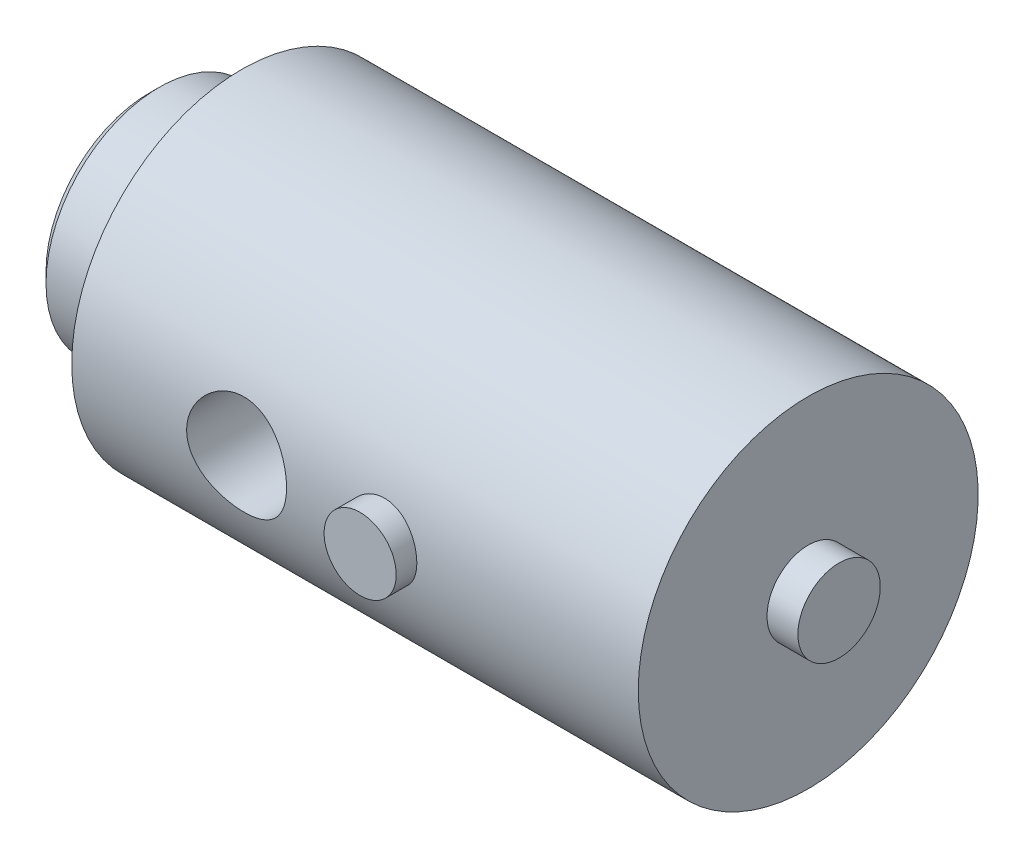
ISO-10303-21;
HEADER;
FILE_DESCRIPTION(('STEP AP214'),'2;1');
FILE_NAME('part.step','',(''),(''),'','','');
FILE_SCHEMA(('AUTOMOTIVE_DESIGN { 1 0 10303 214 1 1 1 1 }'));
ENDSEC;
DATA;
#1=APPLICATION_CONTEXT('core data for automotive mechanical design processes');
#2=APPLICATION_PROTOCOL_DEFINITION('international standard','automotive_design',2000,#1);
#3=PRODUCT_CONTEXT('',#1,'mechanical');
#4=PRODUCT('Part','Part','',(#3));
#5=PRODUCT_RELATED_PRODUCT_CATEGORY('part','',(#4));
#6=PRODUCT_DEFINITION_FORMATION('','',#4);
#7=PRODUCT_DEFINITION_CONTEXT('part definition',#1,'design');
#8=PRODUCT_DEFINITION('design','',#6,#7);
#9=PRODUCT_DEFINITION_SHAPE('','',#8);
#10=(LENGTH_UNIT() NAMED_UNIT(*) SI_UNIT(.MILLI.,.METRE.));
#11=(NAMED_UNIT(*) PLANE_ANGLE_UNIT() SI_UNIT($,.RADIAN.));
#12=(NAMED_UNIT(*) SI_UNIT($,.STERADIAN.) SOLID_ANGLE_UNIT());
#13=UNCERTAINTY_MEASURE_WITH_UNIT(LENGTH_MEASURE(1.E-05),#10,'distance_accuracy_value','');
#14=(GEOMETRIC_REPRESENTATION_CONTEXT(3) GLOBAL_UNCERTAINTY_ASSIGNED_CONTEXT((#13)) GLOBAL_UNIT_ASSIGNED_CONTEXT((#10,
#11,#12)) REPRESENTATION_CONTEXT('',''));
#15=CARTESIAN_POINT('',(0.,0.,0.));
#16=DIRECTION('',(0.,0.,1.));
#17=DIRECTION('',(1.,0.,0.));
#18=AXIS2_PLACEMENT_3D('',#15,#16,#17);
#19=CARTESIAN_POINT('',(0.,0.,0.));
#20=DIRECTION('',(-1.,0.,0.));
#21=DIRECTION('',(0.,0.,1.));
#22=AXIS2_PLACEMENT_3D('',#19,#20,#21);
#23=CYLINDRICAL_SURFACE('',#22,16.5);
#24=CARTESIAN_POINT('',(29.85,0.,16.5));
#25=CARTESIAN_POINT('',(29.8499961196827,-0.266313099430706,16.4999973112837));
#26=CARTESIAN_POINT('',(29.8279922538417,-0.532665609339345,16.4934904971186));
#27=CARTESIAN_POINT('',(29.7407568949876,-1.05762988449565,16.4681684464036));
#28=CARTESIAN_POINT('',(29.6755110262611,-1.31623904558994,16.4493491166101));
#29=CARTESIAN_POINT('',(29.5041469025472,-1.81806796248393,16.4014670005546));
#30=CARTESIAN_POINT('',(29.3980875321022,-2.061309304615,16.3724189770618));
#31=CARTESIAN_POINT('',(29.1483441872767,-2.52655565352261,16.3071081790808));
#32=CARTESIAN_POINT('',(29.0046556599439,-2.74855808604917,16.2708445316633));
#33=CARTESIAN_POINT('',(28.6795410613906,-3.17116857056475,16.1938573265638));
#34=CARTESIAN_POINT('',(28.4972638681665,-3.37110567982261,16.1530451536091));
#35=CARTESIAN_POINT('',(28.1019610925906,-3.73805952591685,16.0720967406786));
#36=CARTESIAN_POINT('',(27.8889305929116,-3.90507098795557,16.0319606099473));
#37=CARTESIAN_POINT('',(27.4325526752913,-4.20491349203635,15.9559772057137));
#38=CARTESIAN_POINT('',(27.1886530114083,-4.33693459213361,15.9202403846904));
#39=CARTESIAN_POINT('',(26.680894774768,-4.55781666639526,15.8584222701326));
#40=CARTESIAN_POINT('',(26.4170407950119,-4.64668753796426,15.8323387627361));
#41=CARTESIAN_POINT('',(25.8843793418325,-4.77634392105235,15.7937023909635));
#42=CARTESIAN_POINT('',(25.6158978167385,-4.8183626222715,15.7808033060013));
#43=CARTESIAN_POINT('',(25.0754100967276,-4.85697165542918,15.7689654189497));
#44=CARTESIAN_POINT('',(24.8034047321296,-4.85357250140307,15.770023385863));
#45=CARTESIAN_POINT('',(24.2735400379876,-4.80241288726491,15.7856726353637));
#46=CARTESIAN_POINT('',(24.0155164366108,-4.75618705372918,15.799795724023));
#47=CARTESIAN_POINT('',(23.5110611243956,-4.62316161456268,15.8392279421637));
#48=CARTESIAN_POINT('',(23.2646305187144,-4.53635814926907,15.8645381357277));
#49=CARTESIAN_POINT('',(22.7865563527456,-4.32348875523525,15.9238734817613));
#50=CARTESIAN_POINT('',(22.5551521445048,-4.19691756137558,15.9580097241808));
#51=CARTESIAN_POINT('',(22.1163486631105,-3.90845697484941,16.0310962904494));
#52=CARTESIAN_POINT('',(21.9089550232761,-3.74655931954656,16.0700477396196));
#53=CARTESIAN_POINT('',(21.5153430358983,-3.38437699013866,16.1502842632036));
#54=CARTESIAN_POINT('',(21.3303036637376,-3.1828157813768,16.1916003575345));
#55=CARTESIAN_POINT('',(20.9963845658037,-2.75100983735299,16.2705270146006));
#56=CARTESIAN_POINT('',(20.8475069381581,-2.52076343892997,16.3081373622508));
#57=CARTESIAN_POINT('',(20.5894598522105,-2.03604079283969,16.3757353654198));
#58=CARTESIAN_POINT('',(20.4805427378995,-1.78142294937746,16.4056742307054));
#59=CARTESIAN_POINT('',(20.30742025289,-1.25640097029208,16.4542044347623));
#60=CARTESIAN_POINT('',(20.2432029287793,-0.98600107601199,16.4727988070613));
#61=CARTESIAN_POINT('',(20.1632443944241,-0.447120678527272,16.4960690980954));
#62=CARTESIAN_POINT('',(20.1459044214456,-0.178896854199385,16.5012038665931));
#63=CARTESIAN_POINT('',(20.1557242210682,0.356641100695489,16.4983174479598));
#64=CARTESIAN_POINT('',(20.1828783131476,0.623955343022091,16.4902979402247));
#65=CARTESIAN_POINT('',(20.2796187472645,1.14411408539238,16.4623037687492));
#66=CARTESIAN_POINT('',(20.3482789471892,1.39714620713867,16.4425902137105));
#67=CARTESIAN_POINT('',(20.5249757063805,1.88805080173555,16.3934795973251));
#68=CARTESIAN_POINT('',(20.6330169265954,2.12592147623325,16.364081389789));
#69=CARTESIAN_POINT('',(20.8881452430914,2.58569646623036,16.2978335161278));
#70=CARTESIAN_POINT('',(21.0360565634191,2.80712081409418,16.2608310055204));
#71=CARTESIAN_POINT('',(21.3657185818254,3.22255405875549,16.1836295535749));
#72=CARTESIAN_POINT('',(21.5474774275044,3.41655633483431,16.1434298439611));
#73=CARTESIAN_POINT('',(21.9471799322096,3.77862265523459,16.0626168452914));
#74=CARTESIAN_POINT('',(22.166161822236,3.94555058412877,16.0220377577234));
#75=CARTESIAN_POINT('',(22.6299089551124,4.24035930094474,15.9465543190043));
#76=CARTESIAN_POINT('',(22.8746734176669,4.36824127011471,15.9116497961967));
#77=CARTESIAN_POINT('',(23.3821493557454,4.58042491099468,15.851872884565));
#78=CARTESIAN_POINT('',(23.6447642423884,4.66494281020275,15.8269508590528));
#79=CARTESIAN_POINT('',(24.181361611196,4.78832494386539,15.7900655833111));
#80=CARTESIAN_POINT('',(24.4553403641565,4.82720403448501,15.7780981162636));
#81=CARTESIAN_POINT('',(24.9951196373536,4.85722292205786,15.7688807678544));
#82=CARTESIAN_POINT('',(25.2608091086529,4.85020947418275,15.7710615190994));
#83=CARTESIAN_POINT('',(25.7870411307971,4.79302700928179,15.788532745172));
#84=CARTESIAN_POINT('',(26.0475838722524,4.74285959355071,15.803822733561));
#85=CARTESIAN_POINT('',(26.5532402953346,4.60196368270533,15.8454154927705));
#86=CARTESIAN_POINT('',(26.7984963517818,4.51170561574423,15.8715903188533));
#87=CARTESIAN_POINT('',(27.2705794212813,4.29355544594646,15.9319846007599));
#88=CARTESIAN_POINT('',(27.4974030082951,4.16565636710857,15.9662055475331));
#89=CARTESIAN_POINT('',(27.9347995139494,3.87059018108712,16.0403369782394));
#90=CARTESIAN_POINT('',(28.1445216005102,3.70220141234594,16.0804051049316));
#91=CARTESIAN_POINT('',(28.5333310327687,3.33315815336859,16.1609304094528));
#92=CARTESIAN_POINT('',(28.7124105144591,3.13249540601069,16.201387684346));
#93=CARTESIAN_POINT('',(29.0397788208968,2.69790892993745,16.2794746451327));
#94=CARTESIAN_POINT('',(29.1870783826878,2.46321840669052,16.3169950943397));
#95=CARTESIAN_POINT('',(29.439916677696,1.97130031618815,16.383693643058));
#96=CARTESIAN_POINT('',(29.545476371879,1.71408414036051,16.4128759277888));
#97=CARTESIAN_POINT('',(29.7015417170053,1.21571352394952,16.4568251477284));
#98=CARTESIAN_POINT('',(29.7570670036022,0.976235037450141,16.4728850294782));
#99=CARTESIAN_POINT('',(29.8312951329554,0.49118158518838,16.4944728941833));
#100=CARTESIAN_POINT('',(29.850003578627,0.245607552828417,16.5000024796717));
#101=CARTESIAN_POINT('',(29.85,0.,16.5));
#102=B_SPLINE_CURVE_WITH_KNOTS('',3,(#24,#25,#26,#27,#28,#29,#30,#31,#32,#33,#34,#35,#36,#37,
#38,#39,#40,#41,#42,#43,#44,#45,#46,#47,#48,#49,#50,#51,#52,#53,#54,#55,#56,#57,#58,#59,#60,#61,
#62,#63,#64,#65,#66,#67,#68,#69,#70,#71,#72,#73,#74,#75,#76,#77,#78,#79,#80,#81,#82,#83,#84,#85,
#86,#87,#88,#89,#90,#91,#92,#93,#94,#95,#96,#97,#98,#99,#100,#101),.UNSPECIFIED.,.T.,.F.,(4,2,2,
2,2,2,2,2,2,2,2,2,2,2,2,2,2,2,2,2,2,2,2,2,2,2,2,2,2,2,2,2,2,2,2,2,2,2,4),(0.,0.798037408396214,
1.59634025583261,2.39349562725644,3.19074749536139,4.00786515665656,4.82511361671978,
5.65989066358918,6.49447614637812,7.30653414806878,8.11840416513239,8.9022625607691,
9.68619553061755,10.4805214854669,11.2750334276726,12.1013286637191,12.9276718304992,
13.7591468851736,14.5903995051053,15.3929215994761,16.1953412444744,16.9804850017565,
17.765721715072,18.5686351606304,19.3717421297548,20.2027670886485,21.0337669042493,
21.860581797459,22.687127474445,23.4806226222081,24.2740883273754,25.05847975614,
25.8430166476538,26.6551147900455,27.4674210347989,28.3022073268708,29.1365738711496,
29.8726767920527,30.608667681576),.UNSPECIFIED.);
#103=CARTESIAN_POINT('',(29.85,0.,16.5));
#104=VERTEX_POINT('',#103);
#105=EDGE_CURVE('E50',#104,#104,#102,.T.);
#106=ORIENTED_EDGE('',*,*,#105,.T.);
#107=EDGE_LOOP('',(#106));
#108=FACE_BOUND('',#107,.T.);
#109=CARTESIAN_POINT('',(9.,0.,0.));
#110=DIRECTION('',(-1.,0.,0.));
#111=DIRECTION('',(0.,0.,1.));
#112=AXIS2_PLACEMENT_3D('',#109,#110,#111);
#113=CIRCLE('',#112,16.5);
#114=CARTESIAN_POINT('',(9.,0.,16.5));
#115=VERTEX_POINT('',#114);
#116=EDGE_CURVE('E118',#115,#115,#113,.T.);
#117=ORIENTED_EDGE('',*,*,#116,.F.);
#118=EDGE_LOOP('',(#117));
#119=FACE_BOUND('',#118,.T.);
#120=CARTESIAN_POINT('',(64.,0.,0.));
#121=DIRECTION('',(-1.,0.,0.));
#122=DIRECTION('',(0.,0.,1.));
#123=AXIS2_PLACEMENT_3D('',#120,#121,#122);
#124=CIRCLE('',#123,16.5);
#125=CARTESIAN_POINT('',(64.,0.,16.5));
#126=VERTEX_POINT('',#125);
#127=EDGE_CURVE('E122',#126,#126,#124,.T.);
#128=ORIENTED_EDGE('',*,*,#127,.T.);
#129=EDGE_LOOP('',(#128));
#130=FACE_BOUND('',#129,.T.);
#131=CARTESIAN_POINT('',(42.5,0.,16.5));
#132=CARTESIAN_POINT('',(42.4999931705558,0.194264094177449,16.4999964044802));
#133=CARTESIAN_POINT('',(42.483771718298,0.388612062608711,16.4965342338051));
#134=CARTESIAN_POINT('',(42.419376115761,0.771797369104911,16.4830571838601));
#135=CARTESIAN_POINT('',(42.3711782081429,0.960630500861025,16.4730374326223));
#136=CARTESIAN_POINT('',(42.244399470396,1.3271920509445,16.447562014769));
#137=CARTESIAN_POINT('',(42.165849428489,1.50493151080402,16.4321118580118));
#138=CARTESIAN_POINT('',(41.980691666812,1.84470019477137,16.3974474968628));
#139=CARTESIAN_POINT('',(41.8740850123512,2.00673001505442,16.3782334353936));
#140=CARTESIAN_POINT('',(41.6341307582363,2.31294194418156,16.3378243865021));
#141=CARTESIAN_POINT('',(41.5004399271634,2.45685203393655,16.3166060568289));
#142=CARTESIAN_POINT('',(41.2108495323176,2.72038194085264,16.2747462992061));
#143=CARTESIAN_POINT('',(41.0549480823527,2.83999969294116,16.2541049204312));
#144=CARTESIAN_POINT('',(40.7233704085339,3.05273424988364,16.215506853875));
#145=CARTESIAN_POINT('',(40.5475064336256,3.14556433663813,16.1975801229439));
#146=CARTESIAN_POINT('',(40.1822326515416,3.30025016034132,16.1667748918201));
#147=CARTESIAN_POINT('',(39.9928243636979,3.36210936523622,16.153895826453));
#148=CARTESIAN_POINT('',(39.6087807640607,3.45220421268329,16.134881330608));
#149=CARTESIAN_POINT('',(39.4142629349619,3.48091991793395,16.1286497191427));
#150=CARTESIAN_POINT('',(39.023078405611,3.50540476346063,16.123346613541));
#151=CARTESIAN_POINT('',(38.8264119558895,3.50117770479475,16.1242742933389));
#152=CARTESIAN_POINT('',(38.4400610229476,3.46028399382049,16.1330977615794));
#153=CARTESIAN_POINT('',(38.2503146630573,3.4241723335735,16.1408743305516));
#154=CARTESIAN_POINT('',(37.8796361540148,3.32141259688932,16.1623311452741));
#155=CARTESIAN_POINT('',(37.6987044734403,3.25476289904208,16.1760117044931));
#156=CARTESIAN_POINT('',(37.3492169190234,3.09230209566767,16.2078541209754));
#157=CARTESIAN_POINT('',(37.1807644781804,2.99627521332777,16.2260489422356));
#158=CARTESIAN_POINT('',(36.8621578004571,2.77793779882189,16.2648492309305));
#159=CARTESIAN_POINT('',(36.7120059206984,2.65562388646772,16.2854550082291));
#160=CARTESIAN_POINT('',(36.43106471709,2.38523440316542,16.3272687899253));
#161=CARTESIAN_POINT('',(36.3007303494925,2.23668625832324,16.3484805279116));
#162=CARTESIAN_POINT('',(36.066752632664,1.91960440087234,16.3887345027697));
#163=CARTESIAN_POINT('',(35.9631097127727,1.75107036684851,16.4077767047412));
#164=CARTESIAN_POINT('',(35.7853548265516,1.39826361016687,16.4416022157862));
#165=CARTESIAN_POINT('',(35.7112997137267,1.21396140548898,16.4563773105887));
#166=CARTESIAN_POINT('',(35.5953338020648,0.835146964389426,16.4799423822177));
#167=CARTESIAN_POINT('',(35.55341861285,0.640636126367403,16.4887331764932));
#168=CARTESIAN_POINT('',(35.5035777008663,0.250830911814965,16.4992237183969));
#169=CARTESIAN_POINT('',(35.4950300972269,0.0556194385508896,16.5010531895944));
#170=CARTESIAN_POINT('',(35.5104853194258,-0.333442068801765,16.4977773137243));
#171=CARTESIAN_POINT('',(35.5344860753577,-0.527292188677317,16.492672407647));
#172=CARTESIAN_POINT('',(35.6138406563073,-0.906087460960539,16.4761829860536));
#173=CARTESIAN_POINT('',(35.6688708683049,-1.09110347991944,16.4648633172323));
#174=CARTESIAN_POINT('',(35.8083650795009,-1.44928017629392,16.4372103391566));
#175=CARTESIAN_POINT('',(35.8928314810556,-1.62243988470773,16.420876620707));
#176=CARTESIAN_POINT('',(36.0901140219996,-1.95457870269865,16.3846860775195));
#177=CARTESIAN_POINT('',(36.2032987883434,-2.11333387532234,16.3647845140462));
#178=CARTESIAN_POINT('',(36.4543168139153,-2.40982088091679,16.3237619674136));
#179=CARTESIAN_POINT('',(36.5921530709255,-2.54755015322092,16.3026408361586));
#180=CARTESIAN_POINT('',(36.8914071896503,-2.80051333602624,16.2611154438391));
#181=CARTESIAN_POINT('',(37.0531910293335,-2.91531791422412,16.2407298497851));
#182=CARTESIAN_POINT('',(37.3941098786673,-3.11612711679662,16.2034016822195));
#183=CARTESIAN_POINT('',(37.5732441542132,-3.20213295897284,16.1864589631323));
#184=CARTESIAN_POINT('',(37.9428349264776,-3.34234090412136,16.1580902163453));
#185=CARTESIAN_POINT('',(38.1332228115971,-3.39671746059298,16.1466339906398));
#186=CARTESIAN_POINT('',(38.5207056795518,-3.47264142483932,16.1304772280984));
#187=CARTESIAN_POINT('',(38.717799658218,-3.49419372578572,16.1257756843356));
#188=CARTESIAN_POINT('',(39.1087779691256,-3.50365885697502,16.1237213588423));
#189=CARTESIAN_POINT('',(39.302645375851,-3.49225152911441,16.1262200584017));
#190=CARTESIAN_POINT('',(39.6856290105543,-3.43763402096647,16.1379502604569));
#191=CARTESIAN_POINT('',(39.8747452877529,-3.39442417028614,16.1471816931733));
#192=CARTESIAN_POINT('',(40.2423572237013,-3.27774768455947,16.1712669542215));
#193=CARTESIAN_POINT('',(40.420883711019,-3.20437436338863,16.1861034313886));
#194=CARTESIAN_POINT('',(40.7631955404407,-3.02953607246545,16.219734942476));
#195=CARTESIAN_POINT('',(40.9269794512881,-2.92806837911073,16.2385303601525));
#196=CARTESIAN_POINT('',(41.2385206622095,-2.69764243312777,16.2784095525067));
#197=CARTESIAN_POINT('',(41.3859132127609,-2.56819730292363,16.2995300998339));
#198=CARTESIAN_POINT('',(41.6571081299805,-2.28648453405488,16.3414267526101));
#199=CARTESIAN_POINT('',(41.7809050512675,-2.13421164166718,16.3622027775429));
#200=CARTESIAN_POINT('',(42.0028152679665,-1.80895775782248,16.4013656827044));
#201=CARTESIAN_POINT('',(42.1006013043477,-1.63574946560375,16.4197207776015));
#202=CARTESIAN_POINT('',(42.2655193335025,-1.27500784464464,16.4516572298663));
#203=CARTESIAN_POINT('',(42.3326777365908,-1.08748702118014,16.465242697764));
#204=CARTESIAN_POINT('',(42.4220864585963,-0.749742540874654,16.4836066292727));
#205=CARTESIAN_POINT('',(42.4512496354438,-0.601382279038568,16.4897168356614));
#206=CARTESIAN_POINT('',(42.4902086786585,-0.302031509733718,16.4979148393599));
#207=CARTESIAN_POINT('',(42.5000053099201,-0.151041106381722,16.5000027955309));
#208=CARTESIAN_POINT('',(42.5,0.,16.5));
#209=B_SPLINE_CURVE_WITH_KNOTS('',3,(#131,#132,#133,#134,#135,#136,#137,#138,#139,#140,#141,
#142,#143,#144,#145,#146,#147,#148,#149,#150,#151,#152,#153,#154,#155,#156,#157,#158,#159,#160,
#161,#162,#163,#164,#165,#166,#167,#168,#169,#170,#171,#172,#173,#174,#175,#176,#177,#178,#179,
#180,#181,#182,#183,#184,#185,#186,#187,#188,#189,#190,#191,#192,#193,#194,#195,#196,#197,#198,
#199,#200,#201,#202,#203,#204,#205,#206,#207,#208),.UNSPECIFIED.,.T.,.F.,(4,2,2,2,2,2,2,2,2,2,2,
2,2,2,2,2,2,2,2,2,2,2,2,2,2,2,2,2,2,2,2,2,2,2,2,2,2,2,4),(0.,0.582239528245088,1.16491212436303,
1.74699522130898,2.32905621975527,2.91901548974928,3.50902489074401,4.10513314202784,
4.70117462950572,5.28846998302151,5.87569757322804,6.45290089116323,7.03013485912686,
7.61171479433909,8.1933695583586,8.78683237740483,9.38030474187546,9.97491205216322,
10.569438123427,11.1528294080977,11.7361835938558,12.3135634829474,12.8909905044042,
13.4762415788997,14.0615638721956,14.6569895105062,15.2523899670904,15.844474525799,
16.4364708127397,17.0163440056148,17.5962111886653,18.1742978318151,18.7524405370741,
19.3415969906027,19.9308892450135,20.5272782716354,21.1231520530044,21.5758634839797,
22.0285570344666),.UNSPECIFIED.);
#210=CARTESIAN_POINT('',(42.5,0.,16.5));
#211=VERTEX_POINT('',#210);
#212=EDGE_CURVE('E10',#211,#211,#209,.T.);
#213=ORIENTED_EDGE('',*,*,#212,.F.);
#214=EDGE_LOOP('',(#213));
#215=FACE_BOUND('',#214,.T.);
#216=ADVANCED_FACE('F38',(#108,#119,#130,#215),#23,.T.);
#217=CARTESIAN_POINT('',(67.,0.,-4.));
#218=DIRECTION('',(-1.,0.,0.));
#219=DIRECTION('',(0.,0.,1.));
#220=AXIS2_PLACEMENT_3D('',#217,#218,#219);
#221=PLANE('',#220);
#222=CARTESIAN_POINT('',(67.,0.,0.));
#223=DIRECTION('',(-1.,0.,0.));
#224=DIRECTION('',(0.,0.,1.));
#225=AXIS2_PLACEMENT_3D('',#222,#223,#224);
#226=CIRCLE('',#225,4.);
#227=CARTESIAN_POINT('',(67.,0.,4.));
#228=VERTEX_POINT('',#227);
#229=EDGE_CURVE('E54',#228,#228,#226,.T.);
#230=ORIENTED_EDGE('',*,*,#229,.F.);
#231=EDGE_LOOP('',(#230));
#232=FACE_BOUND('',#231,.T.);
#233=ADVANCED_FACE('F40',(#232),#221,.F.);
#234=CARTESIAN_POINT('',(0.,0.,0.));
#235=DIRECTION('',(-1.,0.,0.));
#236=DIRECTION('',(0.,0.,1.));
#237=AXIS2_PLACEMENT_3D('',#234,#235,#236);
#238=CYLINDRICAL_SURFACE('',#237,4.);
#239=CARTESIAN_POINT('',(64.,0.,0.));
#240=DIRECTION('',(-1.,0.,0.));
#241=DIRECTION('',(0.,0.,1.));
#242=AXIS2_PLACEMENT_3D('',#239,#240,#241);
#243=CIRCLE('',#242,4.);
#244=CARTESIAN_POINT('',(64.,0.,4.));
#245=VERTEX_POINT('',#244);
#246=EDGE_CURVE('E58',#245,#245,#243,.T.);
#247=ORIENTED_EDGE('',*,*,#246,.F.);
#248=EDGE_LOOP('',(#247));
#249=FACE_BOUND('',#248,.T.);
#250=ORIENTED_EDGE('',*,*,#229,.T.);
#251=EDGE_LOOP('',(#250));
#252=FACE_BOUND('',#251,.T.);
#253=ADVANCED_FACE('F105',(#249,#252),#238,.T.);
#254=CARTESIAN_POINT('',(64.,0.,-16.5));
#255=DIRECTION('',(-1.,0.,0.));
#256=DIRECTION('',(0.,0.,1.));
#257=AXIS2_PLACEMENT_3D('',#254,#255,#256);
#258=PLANE('',#257);
#259=ORIENTED_EDGE('',*,*,#127,.F.);
#260=EDGE_LOOP('',(#259));
#261=FACE_BOUND('',#260,.T.);
#262=ORIENTED_EDGE('',*,*,#246,.T.);
#263=EDGE_LOOP('',(#262));
#264=FACE_BOUND('',#263,.T.);
#265=ADVANCED_FACE('F100',(#261,#264),#258,.F.);
#266=CARTESIAN_POINT('',(9.,0.,-11.));
#267=DIRECTION('',(1.,0.,0.));
#268=DIRECTION('',(0.,0.,-1.));
#269=AXIS2_PLACEMENT_3D('',#266,#267,#268);
#270=PLANE('',#269);
#271=CARTESIAN_POINT('',(9.,0.,0.));
#272=DIRECTION('',(-1.,0.,0.));
#273=DIRECTION('',(0.,0.,1.));
#274=AXIS2_PLACEMENT_3D('',#271,#272,#273);
#275=CIRCLE('',#274,11.);
#276=CARTESIAN_POINT('',(9.,0.,11.));
#277=VERTEX_POINT('',#276);
#278=EDGE_CURVE('E125',#277,#277,#275,.T.);
#279=ORIENTED_EDGE('',*,*,#278,.F.);
#280=EDGE_LOOP('',(#279));
#281=FACE_BOUND('',#280,.T.);
#282=ORIENTED_EDGE('',*,*,#116,.T.);
#283=EDGE_LOOP('',(#282));
#284=FACE_BOUND('',#283,.T.);
#285=ADVANCED_FACE('F97',(#281,#284),#270,.F.);
#286=CARTESIAN_POINT('',(0.,0.,0.));
#287=DIRECTION('',(-1.,0.,0.));
#288=DIRECTION('',(0.,0.,1.));
#289=AXIS2_PLACEMENT_3D('',#286,#287,#288);
#290=CYLINDRICAL_SURFACE('',#289,11.);
#291=CARTESIAN_POINT('',(1.,0.,0.));
#292=DIRECTION('',(-1.,0.,0.));
#293=DIRECTION('',(0.,0.,1.));
#294=AXIS2_PLACEMENT_3D('',#291,#292,#293);
#295=CIRCLE('',#294,11.);
#296=CARTESIAN_POINT('',(1.,0.,11.));
#297=VERTEX_POINT('',#296);
#298=EDGE_CURVE('E130',#297,#297,#295,.T.);
#299=ORIENTED_EDGE('',*,*,#298,.F.);
#300=EDGE_LOOP('',(#299));
#301=FACE_BOUND('',#300,.T.);
#302=ORIENTED_EDGE('',*,*,#278,.T.);
#303=EDGE_LOOP('',(#302));
#304=FACE_BOUND('',#303,.T.);
#305=ADVANCED_FACE('F94',(#301,#304),#290,.T.);
#306=CARTESIAN_POINT('',(1.,0.,0.));
#307=DIRECTION('',(1.,0.,0.));
#308=DIRECTION('',(0.,0.,-1.));
#309=AXIS2_PLACEMENT_3D('',#306,#307,#308);
#310=CONICAL_SURFACE('',#309,11.,0.785398163397448);
#311=CARTESIAN_POINT('',(0.,0.,0.));
#312=DIRECTION('',(-1.,0.,0.));
#313=DIRECTION('',(0.,0.,1.));
#314=AXIS2_PLACEMENT_3D('',#311,#312,#313);
#315=CIRCLE('',#314,10.);
#316=CARTESIAN_POINT('',(0.,0.,10.));
#317=VERTEX_POINT('',#316);
#318=EDGE_CURVE('E133',#317,#317,#315,.T.);
#319=ORIENTED_EDGE('',*,*,#318,.F.);
#320=EDGE_LOOP('',(#319));
#321=FACE_BOUND('',#320,.T.);
#322=ORIENTED_EDGE('',*,*,#298,.T.);
#323=EDGE_LOOP('',(#322));
#324=FACE_BOUND('',#323,.T.);
#325=ADVANCED_FACE('F90',(#321,#324),#310,.T.);
#326=CARTESIAN_POINT('',(0.,0.,-10.));
#327=DIRECTION('',(1.,0.,0.));
#328=DIRECTION('',(0.,0.,-1.));
#329=AXIS2_PLACEMENT_3D('',#326,#327,#328);
#330=PLANE('',#329);
#331=CARTESIAN_POINT('',(0.,0.,0.));
#332=DIRECTION('',(-1.,0.,0.));
#333=DIRECTION('',(0.,0.,1.));
#334=AXIS2_PLACEMENT_3D('',#331,#332,#333);
#335=CIRCLE('',#334,6.);
#336=CARTESIAN_POINT('',(0.,0.,6.));
#337=VERTEX_POINT('',#336);
#338=EDGE_CURVE('E136',#337,#337,#335,.T.);
#339=ORIENTED_EDGE('',*,*,#338,.F.);
#340=EDGE_LOOP('',(#339));
#341=FACE_BOUND('',#340,.T.);
#342=ORIENTED_EDGE('',*,*,#318,.T.);
#343=EDGE_LOOP('',(#342));
#344=FACE_BOUND('',#343,.T.);
#345=ADVANCED_FACE('F86',(#341,#344),#330,.F.);
#346=CARTESIAN_POINT('',(0.,0.,0.));
#347=DIRECTION('',(-1.,0.,0.));
#348=DIRECTION('',(0.,0.,1.));
#349=AXIS2_PLACEMENT_3D('',#346,#347,#348);
#350=CONICAL_SURFACE('',#349,6.,0.785398163397448);
#351=CARTESIAN_POINT('',(2.,0.,0.));
#352=DIRECTION('',(-1.,0.,0.));
#353=DIRECTION('',(0.,0.,1.));
#354=AXIS2_PLACEMENT_3D('',#351,#352,#353);
#355=CIRCLE('',#354,4.);
#356=CARTESIAN_POINT('',(2.,0.,4.));
#357=VERTEX_POINT('',#356);
#358=EDGE_CURVE('E139',#357,#357,#355,.T.);
#359=ORIENTED_EDGE('',*,*,#358,.F.);
#360=EDGE_LOOP('',(#359));
#361=FACE_BOUND('',#360,.T.);
#362=ORIENTED_EDGE('',*,*,#338,.T.);
#363=EDGE_LOOP('',(#362));
#364=FACE_BOUND('',#363,.T.);
#365=ADVANCED_FACE('F82',(#361,#364),#350,.F.);
#366=CARTESIAN_POINT('',(0.,0.,0.));
#367=DIRECTION('',(-1.,0.,0.));
#368=DIRECTION('',(0.,0.,1.));
#369=AXIS2_PLACEMENT_3D('',#366,#367,#368);
#370=CYLINDRICAL_SURFACE('',#369,4.);
#371=CARTESIAN_POINT('',(11.,0.,0.));
#372=DIRECTION('',(-1.,0.,0.));
#373=DIRECTION('',(0.,0.,1.));
#374=AXIS2_PLACEMENT_3D('',#371,#372,#373);
#375=CIRCLE('',#374,4.);
#376=CARTESIAN_POINT('',(11.,0.,4.));
#377=VERTEX_POINT('',#376);
#378=EDGE_CURVE('E142',#377,#377,#375,.T.);
#379=ORIENTED_EDGE('',*,*,#378,.F.);
#380=EDGE_LOOP('',(#379));
#381=FACE_BOUND('',#380,.T.);
#382=ORIENTED_EDGE('',*,*,#358,.T.);
#383=EDGE_LOOP('',(#382));
#384=FACE_BOUND('',#383,.T.);
#385=ADVANCED_FACE('F78',(#381,#384),#370,.F.);
#386=CARTESIAN_POINT('',(11.,0.,-4.));
#387=DIRECTION('',(1.,0.,0.));
#388=DIRECTION('',(0.,0.,-1.));
#389=AXIS2_PLACEMENT_3D('',#386,#387,#388);
#390=PLANE('',#389);
#391=ORIENTED_EDGE('',*,*,#378,.T.);
#392=EDGE_LOOP('',(#391));
#393=FACE_BOUND('',#392,.T.);
#394=ADVANCED_FACE('F74',(#393),#390,.F.);
#395=CARTESIAN_POINT('',(25.,0.,7.5));
#396=DIRECTION('',(0.,0.,1.));
#397=DIRECTION('',(1.,0.,0.));
#398=AXIS2_PLACEMENT_3D('',#395,#396,#397);
#399=CYLINDRICAL_SURFACE('',#398,4.85);
#400=CARTESIAN_POINT('',(25.,0.,7.5));
#401=DIRECTION('',(0.,0.,1.));
#402=DIRECTION('',(1.,0.,0.));
#403=AXIS2_PLACEMENT_3D('',#400,#401,#402);
#404=CIRCLE('',#403,4.85);
#405=CARTESIAN_POINT('',(29.85,0.,7.5));
#406=VERTEX_POINT('',#405);
#407=EDGE_CURVE('E145',#406,#406,#404,.T.);
#408=ORIENTED_EDGE('',*,*,#407,.F.);
#409=EDGE_LOOP('',(#408));
#410=FACE_BOUND('',#409,.T.);
#411=ORIENTED_EDGE('',*,*,#105,.F.);
#412=EDGE_LOOP('',(#411));
#413=FACE_BOUND('',#412,.T.);
#414=ADVANCED_FACE('F68',(#410,#413),#399,.F.);
#415=CARTESIAN_POINT('',(25.,0.,7.5));
#416=DIRECTION('',(0.,0.,1.));
#417=DIRECTION('',(1.,0.,0.));
#418=AXIS2_PLACEMENT_3D('',#415,#416,#417);
#419=PLANE('',#418);
#420=ORIENTED_EDGE('',*,*,#407,.T.);
#421=EDGE_LOOP('',(#420));
#422=FACE_BOUND('',#421,.T.);
#423=ADVANCED_FACE('F73',(#422),#419,.T.);
#424=CARTESIAN_POINT('',(39.,0.,18.5));
#425=DIRECTION('',(0.,0.,-1.));
#426=DIRECTION('',(-1.,0.,0.));
#427=AXIS2_PLACEMENT_3D('',#424,#425,#426);
#428=CYLINDRICAL_SURFACE('',#427,3.5);
#429=CARTESIAN_POINT('',(39.,0.,18.5));
#430=DIRECTION('',(0.,0.,1.));
#431=DIRECTION('',(1.,0.,0.));
#432=AXIS2_PLACEMENT_3D('',#429,#430,#431);
#433=CIRCLE('',#432,3.5);
#434=CARTESIAN_POINT('',(42.5,0.,18.5));
#435=VERTEX_POINT('',#434);
#436=EDGE_CURVE('E148',#435,#435,#433,.T.);
#437=ORIENTED_EDGE('',*,*,#436,.F.);
#438=EDGE_LOOP('',(#437));
#439=FACE_BOUND('',#438,.T.);
#440=ORIENTED_EDGE('',*,*,#212,.T.);
#441=EDGE_LOOP('',(#440));
#442=FACE_BOUND('',#441,.T.);
#443=ADVANCED_FACE('F154',(#439,#442),#428,.T.);
#444=CARTESIAN_POINT('',(39.,0.,18.5));
#445=DIRECTION('',(0.,0.,1.));
#446=DIRECTION('',(1.,0.,0.));
#447=AXIS2_PLACEMENT_3D('',#444,#445,#446);
#448=PLANE('',#447);
#449=ORIENTED_EDGE('',*,*,#436,.T.);
#450=EDGE_LOOP('',(#449));
#451=FACE_BOUND('',#450,.T.);
#452=ADVANCED_FACE('F152',(#451),#448,.T.);
#453=CLOSED_SHELL('',(#216,#233,#253,#265,#285,#305,#325,#345,#365,#385,#394,#414,#423,#443,#452));
#454=MANIFOLD_SOLID_BREP('B2',#453);
#455=ADVANCED_BREP_SHAPE_REPRESENTATION('',(#18,#454),#14);
#456=SHAPE_DEFINITION_REPRESENTATION(#9,#455);
ENDSEC;
END-ISO-10303-21;
